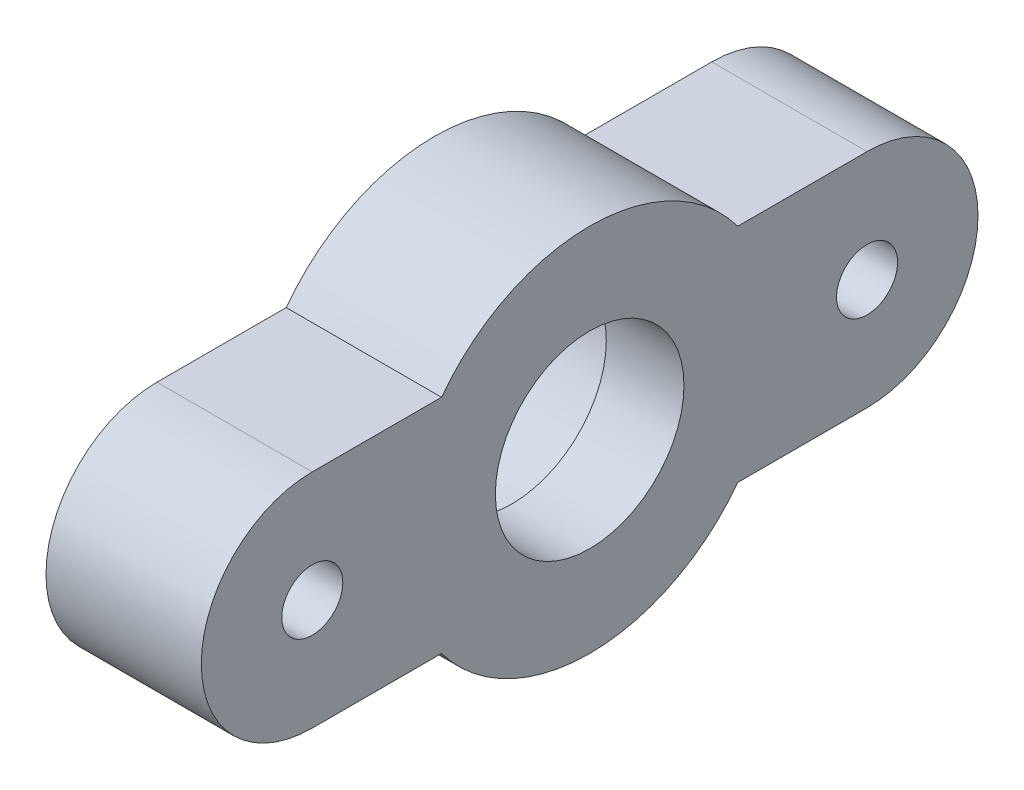
ISO-10303-21;
HEADER;
FILE_DESCRIPTION(('STEP AP214'),'2;1');
FILE_NAME('part.step','',(''),(''),'','','');
FILE_SCHEMA(('AUTOMOTIVE_DESIGN { 1 0 10303 214 1 1 1 1 }'));
ENDSEC;
DATA;
#1=APPLICATION_CONTEXT('core data for automotive mechanical design processes');
#2=APPLICATION_PROTOCOL_DEFINITION('international standard','automotive_design',2000,#1);
#3=PRODUCT_CONTEXT('',#1,'mechanical');
#4=PRODUCT('Part','Part','',(#3));
#5=PRODUCT_RELATED_PRODUCT_CATEGORY('part','',(#4));
#6=PRODUCT_DEFINITION_FORMATION('','',#4);
#7=PRODUCT_DEFINITION_CONTEXT('part definition',#1,'design');
#8=PRODUCT_DEFINITION('design','',#6,#7);
#9=PRODUCT_DEFINITION_SHAPE('','',#8);
#10=(LENGTH_UNIT() NAMED_UNIT(*) SI_UNIT(.MILLI.,.METRE.));
#11=(NAMED_UNIT(*) PLANE_ANGLE_UNIT() SI_UNIT($,.RADIAN.));
#12=(NAMED_UNIT(*) SI_UNIT($,.STERADIAN.) SOLID_ANGLE_UNIT());
#13=UNCERTAINTY_MEASURE_WITH_UNIT(LENGTH_MEASURE(1.E-05),#10,'distance_accuracy_value','');
#14=(GEOMETRIC_REPRESENTATION_CONTEXT(3) GLOBAL_UNCERTAINTY_ASSIGNED_CONTEXT((#13)) GLOBAL_UNIT_ASSIGNED_CONTEXT((#10,
#11,#12)) REPRESENTATION_CONTEXT('',''));
#15=CARTESIAN_POINT('',(0.,0.,0.));
#16=DIRECTION('',(0.,0.,1.));
#17=DIRECTION('',(1.,0.,0.));
#18=AXIS2_PLACEMENT_3D('',#15,#16,#17);
#19=CARTESIAN_POINT('',(0.,0.,0.));
#20=DIRECTION('',(-1.,0.,0.));
#21=DIRECTION('',(0.,0.,1.));
#22=AXIS2_PLACEMENT_3D('',#19,#20,#21);
#23=CYLINDRICAL_SURFACE('',#22,16.6830586475577);
#24=DIRECTION('',(1.,0.,0.));
#25=VECTOR('',#24,1.);
#26=CARTESIAN_POINT('',(0.,-10.,-13.3538176503145));
#27=LINE('',#26,#25);
#28=CARTESIAN_POINT('',(0.,-10.,-13.3538176503145));
#29=VERTEX_POINT('',#28);
#30=CARTESIAN_POINT('',(14.,-10.,-13.3538176503145));
#31=VERTEX_POINT('',#30);
#32=EDGE_CURVE('E146',#29,#31,#27,.T.);
#33=ORIENTED_EDGE('',*,*,#32,.T.);
#34=CARTESIAN_POINT('',(14.,0.,0.));
#35=DIRECTION('',(-1.,0.,0.));
#36=DIRECTION('',(0.,0.,1.));
#37=AXIS2_PLACEMENT_3D('',#34,#35,#36);
#38=CIRCLE('',#37,16.6830586475577);
#39=CARTESIAN_POINT('',(14.,-10.,13.3538176503145));
#40=VERTEX_POINT('',#39);
#41=EDGE_CURVE('E210',#31,#40,#38,.T.);
#42=ORIENTED_EDGE('',*,*,#41,.T.);
#43=DIRECTION('',(1.,0.,0.));
#44=VECTOR('',#43,1.);
#45=CARTESIAN_POINT('',(0.,-10.,13.3538176503145));
#46=LINE('',#45,#44);
#47=CARTESIAN_POINT('',(0.,-10.,13.3538176503145));
#48=VERTEX_POINT('',#47);
#49=EDGE_CURVE('E190',#48,#40,#46,.T.);
#50=ORIENTED_EDGE('',*,*,#49,.F.);
#51=CARTESIAN_POINT('',(0.,0.,0.));
#52=DIRECTION('',(-1.,0.,0.));
#53=DIRECTION('',(0.,0.,1.));
#54=AXIS2_PLACEMENT_3D('',#51,#52,#53);
#55=CIRCLE('',#54,16.6830586475577);
#56=EDGE_CURVE('E48',#29,#48,#55,.T.);
#57=ORIENTED_EDGE('',*,*,#56,.F.);
#58=EDGE_LOOP('',(#33,#42,#50,#57));
#59=FACE_BOUND('',#58,.T.);
#60=ADVANCED_FACE('F39',(#59),#23,.T.);
#61=CARTESIAN_POINT('',(14.,10.,13.3538176503145));
#62=VERTEX_POINT('',#61);
#63=CARTESIAN_POINT('',(14.,10.,-13.3538176503145));
#64=VERTEX_POINT('',#63);
#65=EDGE_CURVE('E211',#62,#64,#38,.T.);
#66=ORIENTED_EDGE('',*,*,#65,.T.);
#67=DIRECTION('',(1.,0.,0.));
#68=VECTOR('',#67,1.);
#69=CARTESIAN_POINT('',(0.,10.,-13.3538176503145));
#70=LINE('',#69,#68);
#71=CARTESIAN_POINT('',(0.,10.,-13.3538176503145));
#72=VERTEX_POINT('',#71);
#73=EDGE_CURVE('E62',#72,#64,#70,.T.);
#74=ORIENTED_EDGE('',*,*,#73,.F.);
#75=CARTESIAN_POINT('',(0.,10.,13.3538176503145));
#76=VERTEX_POINT('',#75);
#77=EDGE_CURVE('E11',#76,#72,#55,.T.);
#78=ORIENTED_EDGE('',*,*,#77,.F.);
#79=DIRECTION('',(1.,0.,0.));
#80=VECTOR('',#79,1.);
#81=CARTESIAN_POINT('',(0.,10.,13.3538176503145));
#82=LINE('',#81,#80);
#83=EDGE_CURVE('E186',#76,#62,#82,.T.);
#84=ORIENTED_EDGE('',*,*,#83,.T.);
#85=EDGE_LOOP('',(#66,#74,#78,#84));
#86=FACE_BOUND('',#85,.T.);
#87=ADVANCED_FACE('F232',(#86),#23,.T.);
#88=CARTESIAN_POINT('',(0.,11.,0.));
#89=DIRECTION('',(1.,0.,0.));
#90=DIRECTION('',(0.,0.,-1.));
#91=AXIS2_PLACEMENT_3D('',#88,#89,#90);
#92=PLANE('',#91);
#93=CARTESIAN_POINT('',(0.,0.,-25.));
#94=DIRECTION('',(1.,0.,0.));
#95=DIRECTION('',(0.,0.,-1.));
#96=AXIS2_PLACEMENT_3D('',#93,#94,#95);
#97=CIRCLE('',#96,2.75);
#98=CARTESIAN_POINT('',(0.,0.,-27.75));
#99=VERTEX_POINT('',#98);
#100=EDGE_CURVE('E137',#99,#99,#97,.T.);
#101=ORIENTED_EDGE('',*,*,#100,.T.);
#102=EDGE_LOOP('',(#101));
#103=FACE_BOUND('',#102,.T.);
#104=CARTESIAN_POINT('',(0.,0.,25.));
#105=DIRECTION('',(1.,0.,0.));
#106=DIRECTION('',(0.,0.,-1.));
#107=AXIS2_PLACEMENT_3D('',#104,#105,#106);
#108=CIRCLE('',#107,2.75);
#109=CARTESIAN_POINT('',(0.,0.,22.25));
#110=VERTEX_POINT('',#109);
#111=EDGE_CURVE('E154',#110,#110,#108,.T.);
#112=ORIENTED_EDGE('',*,*,#111,.T.);
#113=EDGE_LOOP('',(#112));
#114=FACE_BOUND('',#113,.T.);
#115=CARTESIAN_POINT('',(0.,0.,0.));
#116=DIRECTION('',(-1.,0.,0.));
#117=DIRECTION('',(0.,0.,1.));
#118=AXIS2_PLACEMENT_3D('',#115,#116,#117);
#119=CIRCLE('',#118,11.);
#120=CARTESIAN_POINT('',(0.,0.,11.));
#121=VERTEX_POINT('',#120);
#122=EDGE_CURVE('E185',#121,#121,#119,.T.);
#123=ORIENTED_EDGE('',*,*,#122,.F.);
#124=EDGE_LOOP('',(#123));
#125=FACE_BOUND('',#124,.T.);
#126=ORIENTED_EDGE('',*,*,#77,.T.);
#127=DIRECTION('',(0.,0.,1.));
#128=VECTOR('',#127,1.);
#129=CARTESIAN_POINT('',(0.,10.,-25.));
#130=LINE('',#129,#128);
#131=CARTESIAN_POINT('',(0.,10.,-25.));
#132=VERTEX_POINT('',#131);
#133=EDGE_CURVE('E108',#132,#72,#130,.T.);
#134=ORIENTED_EDGE('',*,*,#133,.F.);
#135=CARTESIAN_POINT('',(0.,0.,-25.));
#136=DIRECTION('',(-1.,0.,0.));
#137=DIRECTION('',(0.,0.,1.));
#138=AXIS2_PLACEMENT_3D('',#135,#136,#137);
#139=CIRCLE('',#138,10.);
#140=CARTESIAN_POINT('',(0.,-10.,-25.));
#141=VERTEX_POINT('',#140);
#142=EDGE_CURVE('E119',#132,#141,#139,.T.);
#143=ORIENTED_EDGE('',*,*,#142,.T.);
#144=DIRECTION('',(0.,0.,1.));
#145=VECTOR('',#144,1.);
#146=CARTESIAN_POINT('',(0.,-10.,-25.));
#147=LINE('',#146,#145);
#148=EDGE_CURVE('E115',#141,#29,#147,.T.);
#149=ORIENTED_EDGE('',*,*,#148,.T.);
#150=ORIENTED_EDGE('',*,*,#56,.T.);
#151=DIRECTION('',(0.,0.,-1.));
#152=VECTOR('',#151,1.);
#153=CARTESIAN_POINT('',(0.,-10.,25.));
#154=LINE('',#153,#152);
#155=CARTESIAN_POINT('',(0.,-10.,25.));
#156=VERTEX_POINT('',#155);
#157=EDGE_CURVE('E163',#156,#48,#154,.T.);
#158=ORIENTED_EDGE('',*,*,#157,.F.);
#159=CARTESIAN_POINT('',(0.,0.,25.));
#160=DIRECTION('',(1.,0.,0.));
#161=DIRECTION('',(0.,0.,-1.));
#162=AXIS2_PLACEMENT_3D('',#159,#160,#161);
#163=CIRCLE('',#162,10.);
#164=CARTESIAN_POINT('',(0.,10.,25.));
#165=VERTEX_POINT('',#164);
#166=EDGE_CURVE('E159',#165,#156,#163,.T.);
#167=ORIENTED_EDGE('',*,*,#166,.F.);
#168=DIRECTION('',(0.,0.,-1.));
#169=VECTOR('',#168,1.);
#170=CARTESIAN_POINT('',(0.,10.,25.));
#171=LINE('',#170,#169);
#172=EDGE_CURVE('E168',#165,#76,#171,.T.);
#173=ORIENTED_EDGE('',*,*,#172,.T.);
#174=EDGE_LOOP('',(#126,#134,#143,#149,#150,#158,#167,#173));
#175=FACE_BOUND('',#174,.T.);
#176=ADVANCED_FACE('F41',(#103,#114,#125,#175),#92,.F.);
#177=CARTESIAN_POINT('',(14.,16.6830586475577,0.));
#178=DIRECTION('',(-1.,0.,0.));
#179=DIRECTION('',(0.,0.,1.));
#180=AXIS2_PLACEMENT_3D('',#177,#178,#179);
#181=PLANE('',#180);
#182=CARTESIAN_POINT('',(14.,0.,-25.));
#183=DIRECTION('',(1.,0.,0.));
#184=DIRECTION('',(0.,0.,-1.));
#185=AXIS2_PLACEMENT_3D('',#182,#183,#184);
#186=CIRCLE('',#185,2.75);
#187=CARTESIAN_POINT('',(14.,0.,-27.75));
#188=VERTEX_POINT('',#187);
#189=EDGE_CURVE('E300',#188,#188,#186,.T.);
#190=ORIENTED_EDGE('',*,*,#189,.F.);
#191=EDGE_LOOP('',(#190));
#192=FACE_BOUND('',#191,.T.);
#193=CARTESIAN_POINT('',(14.,0.,25.));
#194=DIRECTION('',(1.,0.,0.));
#195=DIRECTION('',(0.,0.,-1.));
#196=AXIS2_PLACEMENT_3D('',#193,#194,#195);
#197=CIRCLE('',#196,2.75);
#198=CARTESIAN_POINT('',(14.,0.,22.25));
#199=VERTEX_POINT('',#198);
#200=EDGE_CURVE('E145',#199,#199,#197,.T.);
#201=ORIENTED_EDGE('',*,*,#200,.F.);
#202=EDGE_LOOP('',(#201));
#203=FACE_BOUND('',#202,.T.);
#204=ORIENTED_EDGE('',*,*,#65,.F.);
#205=DIRECTION('',(0.,0.,-1.));
#206=VECTOR('',#205,1.);
#207=CARTESIAN_POINT('',(14.,10.,25.));
#208=LINE('',#207,#206);
#209=CARTESIAN_POINT('',(14.,10.,25.));
#210=VERTEX_POINT('',#209);
#211=EDGE_CURVE('E164',#210,#62,#208,.T.);
#212=ORIENTED_EDGE('',*,*,#211,.F.);
#213=CARTESIAN_POINT('',(14.,0.,25.));
#214=DIRECTION('',(1.,0.,0.));
#215=DIRECTION('',(0.,0.,-1.));
#216=AXIS2_PLACEMENT_3D('',#213,#214,#215);
#217=CIRCLE('',#216,10.);
#218=CARTESIAN_POINT('',(14.,-10.,25.));
#219=VERTEX_POINT('',#218);
#220=EDGE_CURVE('E158',#210,#219,#217,.T.);
#221=ORIENTED_EDGE('',*,*,#220,.T.);
#222=DIRECTION('',(0.,0.,-1.));
#223=VECTOR('',#222,1.);
#224=CARTESIAN_POINT('',(14.,-10.,25.));
#225=LINE('',#224,#223);
#226=EDGE_CURVE('E175',#219,#40,#225,.T.);
#227=ORIENTED_EDGE('',*,*,#226,.T.);
#228=ORIENTED_EDGE('',*,*,#41,.F.);
#229=DIRECTION('',(0.,0.,1.));
#230=VECTOR('',#229,1.);
#231=CARTESIAN_POINT('',(14.,-10.,-25.));
#232=LINE('',#231,#230);
#233=CARTESIAN_POINT('',(14.,-10.,-25.));
#234=VERTEX_POINT('',#233);
#235=EDGE_CURVE('E125',#234,#31,#232,.T.);
#236=ORIENTED_EDGE('',*,*,#235,.F.);
#237=CARTESIAN_POINT('',(14.,0.,-25.));
#238=DIRECTION('',(-1.,0.,0.));
#239=DIRECTION('',(0.,0.,1.));
#240=AXIS2_PLACEMENT_3D('',#237,#238,#239);
#241=CIRCLE('',#240,10.);
#242=CARTESIAN_POINT('',(14.,10.,-25.));
#243=VERTEX_POINT('',#242);
#244=EDGE_CURVE('E134',#243,#234,#241,.T.);
#245=ORIENTED_EDGE('',*,*,#244,.F.);
#246=DIRECTION('',(0.,0.,1.));
#247=VECTOR('',#246,1.);
#248=CARTESIAN_POINT('',(14.,10.,-25.));
#249=LINE('',#248,#247);
#250=EDGE_CURVE('E110',#243,#64,#249,.T.);
#251=ORIENTED_EDGE('',*,*,#250,.T.);
#252=EDGE_LOOP('',(#204,#212,#221,#227,#228,#236,#245,#251));
#253=FACE_BOUND('',#252,.T.);
#254=CARTESIAN_POINT('',(14.,0.,0.));
#255=DIRECTION('',(-1.,0.,0.));
#256=DIRECTION('',(0.,0.,1.));
#257=AXIS2_PLACEMENT_3D('',#254,#255,#256);
#258=CIRCLE('',#257,8.5);
#259=CARTESIAN_POINT('',(14.,0.,8.5));
#260=VERTEX_POINT('',#259);
#261=EDGE_CURVE('E207',#260,#260,#258,.T.);
#262=ORIENTED_EDGE('',*,*,#261,.T.);
#263=EDGE_LOOP('',(#262));
#264=FACE_BOUND('',#263,.T.);
#265=ADVANCED_FACE('F221',(#192,#203,#253,#264),#181,.F.);
#266=CARTESIAN_POINT('',(0.,0.,0.));
#267=DIRECTION('',(-1.,0.,0.));
#268=DIRECTION('',(0.,0.,1.));
#269=AXIS2_PLACEMENT_3D('',#266,#267,#268);
#270=CYLINDRICAL_SURFACE('',#269,8.5);
#271=ORIENTED_EDGE('',*,*,#261,.F.);
#272=EDGE_LOOP('',(#271));
#273=FACE_BOUND('',#272,.T.);
#274=CARTESIAN_POINT('',(7.,0.,0.));
#275=DIRECTION('',(-1.,0.,0.));
#276=DIRECTION('',(0.,0.,1.));
#277=AXIS2_PLACEMENT_3D('',#274,#275,#276);
#278=CIRCLE('',#277,8.5);
#279=CARTESIAN_POINT('',(7.,0.,8.5));
#280=VERTEX_POINT('',#279);
#281=EDGE_CURVE('E203',#280,#280,#278,.T.);
#282=ORIENTED_EDGE('',*,*,#281,.T.);
#283=EDGE_LOOP('',(#282));
#284=FACE_BOUND('',#283,.T.);
#285=ADVANCED_FACE('F253',(#273,#284),#270,.F.);
#286=CARTESIAN_POINT('',(7.,8.5,0.));
#287=DIRECTION('',(1.,0.,0.));
#288=DIRECTION('',(0.,0.,-1.));
#289=AXIS2_PLACEMENT_3D('',#286,#287,#288);
#290=PLANE('',#289);
#291=ORIENTED_EDGE('',*,*,#281,.F.);
#292=EDGE_LOOP('',(#291));
#293=FACE_BOUND('',#292,.T.);
#294=CARTESIAN_POINT('',(7.,0.,0.));
#295=DIRECTION('',(-1.,0.,0.));
#296=DIRECTION('',(0.,0.,1.));
#297=AXIS2_PLACEMENT_3D('',#294,#295,#296);
#298=CIRCLE('',#297,11.);
#299=CARTESIAN_POINT('',(7.,0.,11.));
#300=VERTEX_POINT('',#299);
#301=EDGE_CURVE('E199',#300,#300,#298,.T.);
#302=ORIENTED_EDGE('',*,*,#301,.T.);
#303=EDGE_LOOP('',(#302));
#304=FACE_BOUND('',#303,.T.);
#305=ADVANCED_FACE('F257',(#293,#304),#290,.F.);
#306=CARTESIAN_POINT('',(0.,0.,0.));
#307=DIRECTION('',(-1.,0.,0.));
#308=DIRECTION('',(0.,0.,1.));
#309=AXIS2_PLACEMENT_3D('',#306,#307,#308);
#310=CYLINDRICAL_SURFACE('',#309,11.);
#311=ORIENTED_EDGE('',*,*,#301,.F.);
#312=EDGE_LOOP('',(#311));
#313=FACE_BOUND('',#312,.T.);
#314=ORIENTED_EDGE('',*,*,#122,.T.);
#315=EDGE_LOOP('',(#314));
#316=FACE_BOUND('',#315,.T.);
#317=ADVANCED_FACE('F243',(#313,#316),#310,.F.);
#318=CARTESIAN_POINT('',(0.,0.,25.));
#319=DIRECTION('',(1.,0.,0.));
#320=DIRECTION('',(0.,0.,-1.));
#321=AXIS2_PLACEMENT_3D('',#318,#319,#320);
#322=CYLINDRICAL_SURFACE('',#321,10.);
#323=ORIENTED_EDGE('',*,*,#220,.F.);
#324=DIRECTION('',(1.,0.,0.));
#325=VECTOR('',#324,1.);
#326=CARTESIAN_POINT('',(0.,10.,25.));
#327=LINE('',#326,#325);
#328=EDGE_CURVE('E182',#165,#210,#327,.T.);
#329=ORIENTED_EDGE('',*,*,#328,.F.);
#330=ORIENTED_EDGE('',*,*,#166,.T.);
#331=DIRECTION('',(1.,0.,0.));
#332=VECTOR('',#331,1.);
#333=CARTESIAN_POINT('',(0.,-10.,25.));
#334=LINE('',#333,#332);
#335=EDGE_CURVE('E171',#156,#219,#334,.T.);
#336=ORIENTED_EDGE('',*,*,#335,.T.);
#337=EDGE_LOOP('',(#323,#329,#330,#336));
#338=FACE_BOUND('',#337,.T.);
#339=ADVANCED_FACE('F226',(#338),#322,.T.);
#340=CARTESIAN_POINT('',(0.,10.,25.));
#341=DIRECTION('',(0.,-1.,0.));
#342=DIRECTION('',(0.,0.,-1.));
#343=AXIS2_PLACEMENT_3D('',#340,#341,#342);
#344=PLANE('',#343);
#345=ORIENTED_EDGE('',*,*,#211,.T.);
#346=ORIENTED_EDGE('',*,*,#83,.F.);
#347=ORIENTED_EDGE('',*,*,#172,.F.);
#348=ORIENTED_EDGE('',*,*,#328,.T.);
#349=EDGE_LOOP('',(#345,#346,#347,#348));
#350=FACE_BOUND('',#349,.T.);
#351=ADVANCED_FACE('F234',(#350),#344,.F.);
#352=CARTESIAN_POINT('',(0.,-10.,25.));
#353=DIRECTION('',(0.,-1.,0.));
#354=DIRECTION('',(0.,0.,-1.));
#355=AXIS2_PLACEMENT_3D('',#352,#353,#354);
#356=PLANE('',#355);
#357=ORIENTED_EDGE('',*,*,#226,.F.);
#358=ORIENTED_EDGE('',*,*,#335,.F.);
#359=ORIENTED_EDGE('',*,*,#157,.T.);
#360=ORIENTED_EDGE('',*,*,#49,.T.);
#361=EDGE_LOOP('',(#357,#358,#359,#360));
#362=FACE_BOUND('',#361,.T.);
#363=ADVANCED_FACE('F219',(#362),#356,.T.);
#364=CARTESIAN_POINT('',(14.,0.,25.));
#365=DIRECTION('',(1.,0.,0.));
#366=DIRECTION('',(0.,0.,-1.));
#367=AXIS2_PLACEMENT_3D('',#364,#365,#366);
#368=CYLINDRICAL_SURFACE('',#367,2.75);
#369=ORIENTED_EDGE('',*,*,#111,.F.);
#370=EDGE_LOOP('',(#369));
#371=FACE_BOUND('',#370,.T.);
#372=ORIENTED_EDGE('',*,*,#200,.T.);
#373=EDGE_LOOP('',(#372));
#374=FACE_BOUND('',#373,.T.);
#375=ADVANCED_FACE('F241',(#371,#374),#368,.F.);
#376=CARTESIAN_POINT('',(0.,0.,-25.));
#377=DIRECTION('',(1.,0.,0.));
#378=DIRECTION('',(0.,0.,-1.));
#379=AXIS2_PLACEMENT_3D('',#376,#377,#378);
#380=CYLINDRICAL_SURFACE('',#379,10.);
#381=ORIENTED_EDGE('',*,*,#244,.T.);
#382=DIRECTION('',(1.,0.,0.));
#383=VECTOR('',#382,1.);
#384=CARTESIAN_POINT('',(0.,-10.,-25.));
#385=LINE('',#384,#383);
#386=EDGE_CURVE('E122',#141,#234,#385,.T.);
#387=ORIENTED_EDGE('',*,*,#386,.F.);
#388=ORIENTED_EDGE('',*,*,#142,.F.);
#389=DIRECTION('',(1.,0.,0.));
#390=VECTOR('',#389,1.);
#391=CARTESIAN_POINT('',(0.,10.,-25.));
#392=LINE('',#391,#390);
#393=EDGE_CURVE('E104',#132,#243,#392,.T.);
#394=ORIENTED_EDGE('',*,*,#393,.T.);
#395=EDGE_LOOP('',(#381,#387,#388,#394));
#396=FACE_BOUND('',#395,.T.);
#397=ADVANCED_FACE('F120',(#396),#380,.T.);
#398=CARTESIAN_POINT('',(0.,-10.,-25.));
#399=DIRECTION('',(0.,1.,0.));
#400=DIRECTION('',(0.,0.,1.));
#401=AXIS2_PLACEMENT_3D('',#398,#399,#400);
#402=PLANE('',#401);
#403=ORIENTED_EDGE('',*,*,#235,.T.);
#404=ORIENTED_EDGE('',*,*,#32,.F.);
#405=ORIENTED_EDGE('',*,*,#148,.F.);
#406=ORIENTED_EDGE('',*,*,#386,.T.);
#407=EDGE_LOOP('',(#403,#404,#405,#406));
#408=FACE_BOUND('',#407,.T.);
#409=ADVANCED_FACE('F230',(#408),#402,.F.);
#410=CARTESIAN_POINT('',(0.,10.,-25.));
#411=DIRECTION('',(0.,1.,0.));
#412=DIRECTION('',(0.,0.,1.));
#413=AXIS2_PLACEMENT_3D('',#410,#411,#412);
#414=PLANE('',#413);
#415=ORIENTED_EDGE('',*,*,#250,.F.);
#416=ORIENTED_EDGE('',*,*,#393,.F.);
#417=ORIENTED_EDGE('',*,*,#133,.T.);
#418=ORIENTED_EDGE('',*,*,#73,.T.);
#419=EDGE_LOOP('',(#415,#416,#417,#418));
#420=FACE_BOUND('',#419,.T.);
#421=ADVANCED_FACE('F106',(#420),#414,.T.);
#422=CARTESIAN_POINT('',(14.,0.,-25.));
#423=DIRECTION('',(1.,0.,0.));
#424=DIRECTION('',(0.,0.,-1.));
#425=AXIS2_PLACEMENT_3D('',#422,#423,#424);
#426=CYLINDRICAL_SURFACE('',#425,2.75);
#427=ORIENTED_EDGE('',*,*,#100,.F.);
#428=EDGE_LOOP('',(#427));
#429=FACE_BOUND('',#428,.T.);
#430=ORIENTED_EDGE('',*,*,#189,.T.);
#431=EDGE_LOOP('',(#430));
#432=FACE_BOUND('',#431,.T.);
#433=ADVANCED_FACE('F290',(#429,#432),#426,.F.);
#434=CLOSED_SHELL('',(#60,#87,#176,#265,#285,#305,#317,#339,#351,#363,#375,#397,#409,#421,#433));
#435=MANIFOLD_SOLID_BREP('B2',#434);
#436=ADVANCED_BREP_SHAPE_REPRESENTATION('',(#18,#435),#14);
#437=SHAPE_DEFINITION_REPRESENTATION(#9,#436);
ENDSEC;
END-ISO-10303-21;
